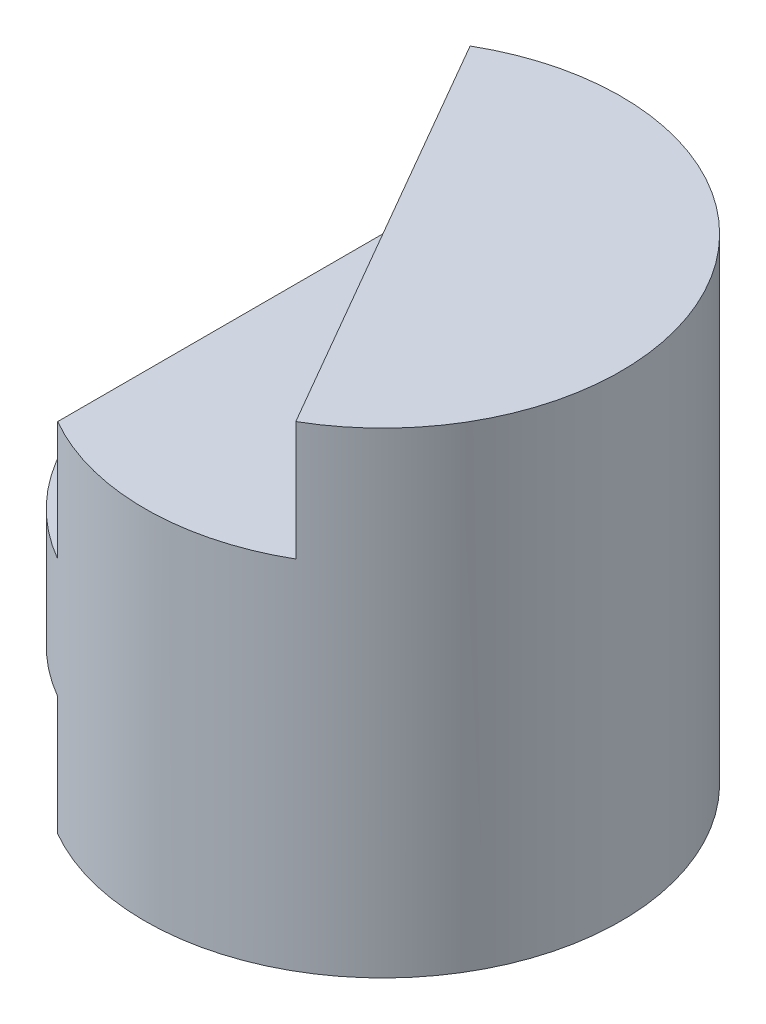
ISO-10303-21;
HEADER;
FILE_DESCRIPTION(('STEP AP214'),'2;1');
FILE_NAME('part.step','',(''),(''),'','','');
FILE_SCHEMA(('AUTOMOTIVE_DESIGN { 1 0 10303 214 1 1 1 1 }'));
ENDSEC;
DATA;
#1=APPLICATION_CONTEXT('core data for automotive mechanical design processes');
#2=APPLICATION_PROTOCOL_DEFINITION('international standard','automotive_design',2000,#1);
#3=PRODUCT_CONTEXT('',#1,'mechanical');
#4=PRODUCT('Part','Part','',(#3));
#5=PRODUCT_RELATED_PRODUCT_CATEGORY('part','',(#4));
#6=PRODUCT_DEFINITION_FORMATION('','',#4);
#7=PRODUCT_DEFINITION_CONTEXT('part definition',#1,'design');
#8=PRODUCT_DEFINITION('design','',#6,#7);
#9=PRODUCT_DEFINITION_SHAPE('','',#8);
#10=(LENGTH_UNIT() NAMED_UNIT(*) SI_UNIT(.MILLI.,.METRE.));
#11=(NAMED_UNIT(*) PLANE_ANGLE_UNIT() SI_UNIT($,.RADIAN.));
#12=(NAMED_UNIT(*) SI_UNIT($,.STERADIAN.) SOLID_ANGLE_UNIT());
#13=UNCERTAINTY_MEASURE_WITH_UNIT(LENGTH_MEASURE(1.E-05),#10,'distance_accuracy_value','');
#14=(GEOMETRIC_REPRESENTATION_CONTEXT(3) GLOBAL_UNCERTAINTY_ASSIGNED_CONTEXT((#13)) GLOBAL_UNIT_ASSIGNED_CONTEXT((#10,
#11,#12)) REPRESENTATION_CONTEXT('',''));
#15=CARTESIAN_POINT('',(0.,0.,0.));
#16=DIRECTION('',(0.,0.,1.));
#17=DIRECTION('',(1.,0.,0.));
#18=AXIS2_PLACEMENT_3D('',#15,#16,#17);
#19=CARTESIAN_POINT('',(0.,4.,0.));
#20=DIRECTION('',(0.,-1.,0.));
#21=DIRECTION('',(0.,0.,-1.));
#22=AXIS2_PLACEMENT_3D('',#19,#20,#21);
#23=CYLINDRICAL_SURFACE('',#22,2.);
#24=CARTESIAN_POINT('',(0.,1.,0.));
#25=DIRECTION('',(0.,1.,0.));
#26=DIRECTION('',(0.,0.,1.));
#27=AXIS2_PLACEMENT_3D('',#24,#25,#26);
#28=CIRCLE('',#27,2.);
#29=CARTESIAN_POINT('',(-1.,1.,-1.73205080756888));
#30=VERTEX_POINT('',#29);
#31=CARTESIAN_POINT('',(-1.,1.,1.73205080756888));
#32=VERTEX_POINT('',#31);
#33=EDGE_CURVE('E40',#30,#32,#28,.T.);
#34=ORIENTED_EDGE('',*,*,#33,.T.);
#35=DIRECTION('',(0.,-1.,0.));
#36=VECTOR('',#35,1.);
#37=CARTESIAN_POINT('',(-1.,4.,1.73205080756888));
#38=LINE('',#37,#36);
#39=CARTESIAN_POINT('',(-1.,0.,1.73205080756888));
#40=VERTEX_POINT('',#39);
#41=EDGE_CURVE('E112',#32,#40,#38,.T.);
#42=ORIENTED_EDGE('',*,*,#41,.T.);
#43=CARTESIAN_POINT('',(0.,0.,0.));
#44=DIRECTION('',(0.,1.,0.));
#45=DIRECTION('',(0.,0.,1.));
#46=AXIS2_PLACEMENT_3D('',#43,#44,#45);
#47=CIRCLE('',#46,2.);
#48=CARTESIAN_POINT('',(-1.,0.,-1.73205080756888));
#49=VERTEX_POINT('',#48);
#50=EDGE_CURVE('E90',#40,#49,#47,.T.);
#51=ORIENTED_EDGE('',*,*,#50,.T.);
#52=DIRECTION('',(0.,-1.,0.));
#53=VECTOR('',#52,1.);
#54=CARTESIAN_POINT('',(-1.,4.,-1.73205080756888));
#55=LINE('',#54,#53);
#56=EDGE_CURVE('E106',#49,#30,#55,.F.);
#57=ORIENTED_EDGE('',*,*,#56,.T.);
#58=EDGE_LOOP('',(#34,#42,#51,#57));
#59=FACE_BOUND('',#58,.T.);
#60=DIRECTION('',(0.,-1.,0.));
#61=VECTOR('',#60,1.);
#62=CARTESIAN_POINT('',(1.,12.6602540378444,1.73205080756888));
#63=LINE('',#62,#61);
#64=CARTESIAN_POINT('',(1.,4.,1.73205080756888));
#65=VERTEX_POINT('',#64);
#66=CARTESIAN_POINT('',(1.,3.,1.73205080756888));
#67=VERTEX_POINT('',#66);
#68=EDGE_CURVE('E47',#65,#67,#63,.T.);
#69=ORIENTED_EDGE('',*,*,#68,.T.);
#70=CARTESIAN_POINT('',(0.,3.,0.));
#71=DIRECTION('',(0.,1.,0.));
#72=DIRECTION('',(0.,0.,1.));
#73=AXIS2_PLACEMENT_3D('',#70,#71,#72);
#74=CIRCLE('',#73,2.);
#75=CARTESIAN_POINT('',(-1.,3.,1.73205080756888));
#76=VERTEX_POINT('',#75);
#77=EDGE_CURVE('E93',#76,#67,#74,.T.);
#78=ORIENTED_EDGE('',*,*,#77,.F.);
#79=DIRECTION('',(0.,-1.,0.));
#80=VECTOR('',#79,1.);
#81=CARTESIAN_POINT('',(-1.,4.,1.73205080756888));
#82=LINE('',#81,#80);
#83=CARTESIAN_POINT('',(-1.,2.,1.73205080756888));
#84=VERTEX_POINT('',#83);
#85=EDGE_CURVE('E82',#76,#84,#82,.T.);
#86=ORIENTED_EDGE('',*,*,#85,.T.);
#87=CARTESIAN_POINT('',(0.,2.,0.));
#88=DIRECTION('',(0.,-1.,0.));
#89=DIRECTION('',(1.,0.,0.));
#90=AXIS2_PLACEMENT_3D('',#87,#88,#89);
#91=CIRCLE('',#90,2.);
#92=CARTESIAN_POINT('',(-1.,2.,-1.73205080756888));
#93=VERTEX_POINT('',#92);
#94=EDGE_CURVE('E11',#84,#93,#91,.T.);
#95=ORIENTED_EDGE('',*,*,#94,.T.);
#96=DIRECTION('',(0.,-1.,0.));
#97=VECTOR('',#96,1.);
#98=CARTESIAN_POINT('',(-1.,4.,-1.73205080756888));
#99=LINE('',#98,#97);
#100=CARTESIAN_POINT('',(-1.,3.,-1.73205080756888));
#101=VERTEX_POINT('',#100);
#102=EDGE_CURVE('E91',#93,#101,#99,.F.);
#103=ORIENTED_EDGE('',*,*,#102,.T.);
#104=DIRECTION('',(0.,-1.,0.));
#105=VECTOR('',#104,1.);
#106=CARTESIAN_POINT('',(-1.,12.6602540378444,-1.73205080756888));
#107=LINE('',#106,#105);
#108=CARTESIAN_POINT('',(-1.,4.,-1.73205080756888));
#109=VERTEX_POINT('',#108);
#110=EDGE_CURVE('E161',#109,#101,#107,.T.);
#111=ORIENTED_EDGE('',*,*,#110,.F.);
#112=CARTESIAN_POINT('',(0.,4.,0.));
#113=DIRECTION('',(0.,1.,0.));
#114=DIRECTION('',(0.,0.,1.));
#115=AXIS2_PLACEMENT_3D('',#112,#113,#114);
#116=CIRCLE('',#115,2.);
#117=EDGE_CURVE('E116',#65,#109,#116,.T.);
#118=ORIENTED_EDGE('',*,*,#117,.F.);
#119=EDGE_LOOP('',(#69,#78,#86,#95,#103,#111,#118));
#120=FACE_BOUND('',#119,.T.);
#121=ADVANCED_FACE('F33',(#59,#120),#23,.T.);
#122=CARTESIAN_POINT('',(0.,4.,0.));
#123=DIRECTION('',(0.,1.,0.));
#124=DIRECTION('',(0.,0.,1.));
#125=AXIS2_PLACEMENT_3D('',#122,#123,#124);
#126=PLANE('',#125);
#127=ORIENTED_EDGE('',*,*,#117,.T.);
#128=DIRECTION('',(-0.5,0.,-0.866025403784439));
#129=VECTOR('',#128,1.);
#130=CARTESIAN_POINT('',(1.,4.,1.73205080756888));
#131=LINE('',#130,#129);
#132=EDGE_CURVE('E54',#65,#109,#131,.T.);
#133=ORIENTED_EDGE('',*,*,#132,.F.);
#134=EDGE_LOOP('',(#127,#133));
#135=FACE_BOUND('',#134,.T.);
#136=ADVANCED_FACE('F138',(#135),#126,.T.);
#137=CARTESIAN_POINT('',(-1.,4.,-2.));
#138=DIRECTION('',(1.,0.,0.));
#139=DIRECTION('',(0.,1.,0.));
#140=AXIS2_PLACEMENT_3D('',#137,#138,#139);
#141=PLANE('',#140);
#142=DIRECTION('',(0.,0.,-1.));
#143=VECTOR('',#142,1.);
#144=CARTESIAN_POINT('',(-1.,3.,0.));
#145=LINE('',#144,#143);
#146=EDGE_CURVE('E85',#76,#101,#145,.T.);
#147=ORIENTED_EDGE('',*,*,#146,.T.);
#148=ORIENTED_EDGE('',*,*,#102,.F.);
#149=DIRECTION('',(0.,0.,1.));
#150=VECTOR('',#149,1.);
#151=CARTESIAN_POINT('',(-1.,2.,-2.));
#152=LINE('',#151,#150);
#153=EDGE_CURVE('E88',#93,#84,#152,.T.);
#154=ORIENTED_EDGE('',*,*,#153,.T.);
#155=ORIENTED_EDGE('',*,*,#85,.F.);
#156=EDGE_LOOP('',(#147,#148,#154,#155));
#157=FACE_BOUND('',#156,.T.);
#158=ADVANCED_FACE('F83',(#157),#141,.F.);
#159=CARTESIAN_POINT('',(0.,0.,0.));
#160=DIRECTION('',(0.,1.,0.));
#161=DIRECTION('',(0.,0.,1.));
#162=AXIS2_PLACEMENT_3D('',#159,#160,#161);
#163=PLANE('',#162);
#164=ORIENTED_EDGE('',*,*,#50,.F.);
#165=DIRECTION('',(0.,0.,-1.));
#166=VECTOR('',#165,1.);
#167=CARTESIAN_POINT('',(-1.,0.,0.));
#168=LINE('',#167,#166);
#169=EDGE_CURVE('E118',#40,#49,#168,.T.);
#170=ORIENTED_EDGE('',*,*,#169,.T.);
#171=EDGE_LOOP('',(#164,#170));
#172=FACE_BOUND('',#171,.T.);
#173=ADVANCED_FACE('F131',(#172),#163,.F.);
#174=CARTESIAN_POINT('',(-1.,1.,-2.));
#175=DIRECTION('',(0.,1.,0.));
#176=DIRECTION('',(0.,0.,1.));
#177=AXIS2_PLACEMENT_3D('',#174,#175,#176);
#178=PLANE('',#177);
#179=DIRECTION('',(0.,0.,1.));
#180=VECTOR('',#179,1.);
#181=CARTESIAN_POINT('',(-1.,1.,-2.));
#182=LINE('',#181,#180);
#183=EDGE_CURVE('E107',#30,#32,#182,.T.);
#184=ORIENTED_EDGE('',*,*,#183,.T.);
#185=ORIENTED_EDGE('',*,*,#33,.F.);
#186=EDGE_LOOP('',(#184,#185));
#187=FACE_BOUND('',#186,.T.);
#188=ADVANCED_FACE('F127',(#187),#178,.F.);
#189=CARTESIAN_POINT('',(-1.,1.,-2.));
#190=DIRECTION('',(1.,0.,0.));
#191=DIRECTION('',(0.,0.,-1.));
#192=AXIS2_PLACEMENT_3D('',#189,#190,#191);
#193=PLANE('',#192);
#194=ORIENTED_EDGE('',*,*,#183,.F.);
#195=ORIENTED_EDGE('',*,*,#56,.F.);
#196=ORIENTED_EDGE('',*,*,#169,.F.);
#197=ORIENTED_EDGE('',*,*,#41,.F.);
#198=EDGE_LOOP('',(#194,#195,#196,#197));
#199=FACE_BOUND('',#198,.T.);
#200=ADVANCED_FACE('F129',(#199),#193,.F.);
#201=CARTESIAN_POINT('',(-1.,2.,-2.));
#202=DIRECTION('',(0.,-1.,0.));
#203=DIRECTION('',(1.,0.,0.));
#204=AXIS2_PLACEMENT_3D('',#201,#202,#203);
#205=PLANE('',#204);
#206=ORIENTED_EDGE('',*,*,#153,.F.);
#207=ORIENTED_EDGE('',*,*,#94,.F.);
#208=EDGE_LOOP('',(#206,#207));
#209=FACE_BOUND('',#208,.T.);
#210=ADVANCED_FACE('F149',(#209),#205,.F.);
#211=CARTESIAN_POINT('',(1.,12.6602540378444,1.73205080756888));
#212=DIRECTION('',(-0.866025403784439,0.,0.5));
#213=DIRECTION('',(0.5,0.,0.866025403784439));
#214=AXIS2_PLACEMENT_3D('',#211,#212,#213);
#215=PLANE('',#214);
#216=ORIENTED_EDGE('',*,*,#68,.F.);
#217=ORIENTED_EDGE('',*,*,#132,.T.);
#218=ORIENTED_EDGE('',*,*,#110,.T.);
#219=DIRECTION('',(-0.5,0.,-0.866025403784439));
#220=VECTOR('',#219,1.);
#221=CARTESIAN_POINT('',(1.,3.,1.73205080756888));
#222=LINE('',#221,#220);
#223=EDGE_CURVE('E97',#67,#101,#222,.T.);
#224=ORIENTED_EDGE('',*,*,#223,.F.);
#225=EDGE_LOOP('',(#216,#217,#218,#224));
#226=FACE_BOUND('',#225,.T.);
#227=ADVANCED_FACE('F152',(#226),#215,.T.);
#228=CARTESIAN_POINT('',(0.,3.,0.));
#229=DIRECTION('',(0.,1.,0.));
#230=DIRECTION('',(0.,0.,1.));
#231=AXIS2_PLACEMENT_3D('',#228,#229,#230);
#232=PLANE('',#231);
#233=ORIENTED_EDGE('',*,*,#223,.T.);
#234=ORIENTED_EDGE('',*,*,#146,.F.);
#235=ORIENTED_EDGE('',*,*,#77,.T.);
#236=EDGE_LOOP('',(#233,#234,#235));
#237=FACE_BOUND('',#236,.T.);
#238=ADVANCED_FACE('F99',(#237),#232,.T.);
#239=CLOSED_SHELL('',(#121,#136,#158,#173,#188,#200,#210,#227,#238));
#240=MANIFOLD_SOLID_BREP('B2',#239);
#241=ADVANCED_BREP_SHAPE_REPRESENTATION('',(#18,#240),#14);
#242=SHAPE_DEFINITION_REPRESENTATION(#9,#241);
ENDSEC;
END-ISO-10303-21;
